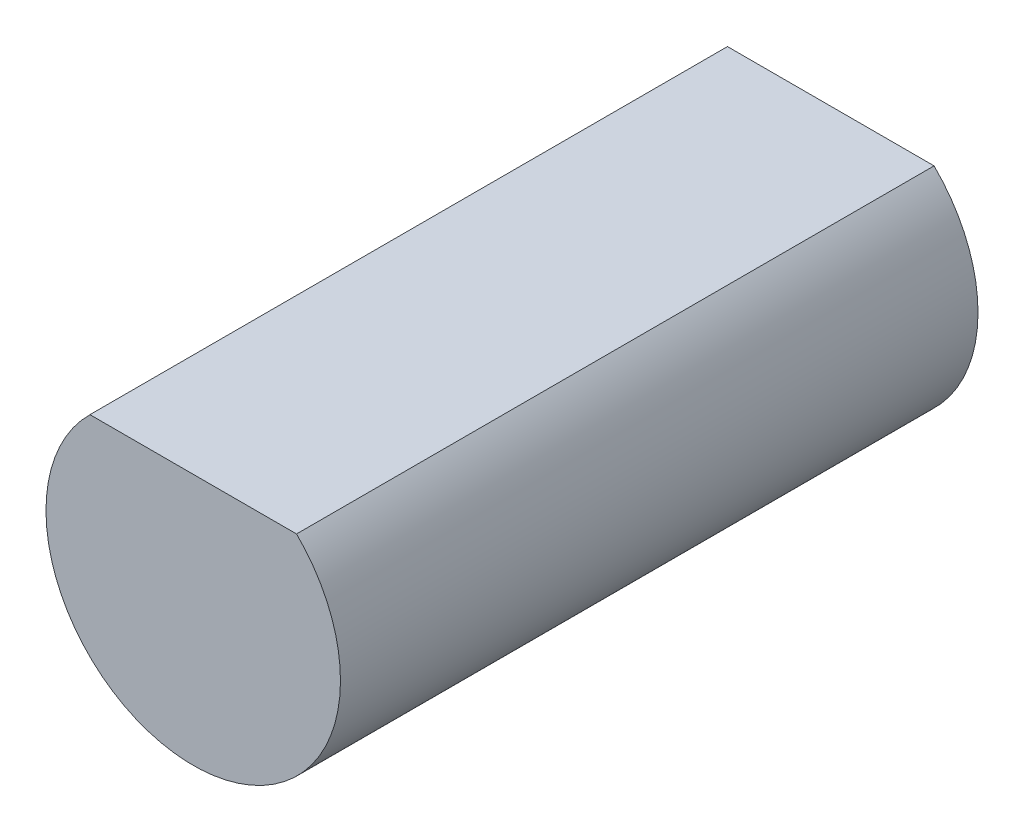
ISO-10303-21;
HEADER;
FILE_DESCRIPTION(('STEP AP214'),'2;1');
FILE_NAME('part.step','',(''),(''),'','','');
FILE_SCHEMA(('AUTOMOTIVE_DESIGN { 1 0 10303 214 1 1 1 1 }'));
ENDSEC;
DATA;
#1=APPLICATION_CONTEXT('core data for automotive mechanical design processes');
#2=APPLICATION_PROTOCOL_DEFINITION('international standard','automotive_design',2000,#1);
#3=PRODUCT_CONTEXT('',#1,'mechanical');
#4=PRODUCT('Part','Part','',(#3));
#5=PRODUCT_RELATED_PRODUCT_CATEGORY('part','',(#4));
#6=PRODUCT_DEFINITION_FORMATION('','',#4);
#7=PRODUCT_DEFINITION_CONTEXT('part definition',#1,'design');
#8=PRODUCT_DEFINITION('design','',#6,#7);
#9=PRODUCT_DEFINITION_SHAPE('','',#8);
#10=(LENGTH_UNIT() NAMED_UNIT(*) SI_UNIT(.MILLI.,.METRE.));
#11=(NAMED_UNIT(*) PLANE_ANGLE_UNIT() SI_UNIT($,.RADIAN.));
#12=(NAMED_UNIT(*) SI_UNIT($,.STERADIAN.) SOLID_ANGLE_UNIT());
#13=UNCERTAINTY_MEASURE_WITH_UNIT(LENGTH_MEASURE(1.E-05),#10,'distance_accuracy_value','');
#14=(GEOMETRIC_REPRESENTATION_CONTEXT(3) GLOBAL_UNCERTAINTY_ASSIGNED_CONTEXT((#13)) GLOBAL_UNIT_ASSIGNED_CONTEXT((#10,
#11,#12)) REPRESENTATION_CONTEXT('',''));
#15=CARTESIAN_POINT('',(0.,0.,0.));
#16=DIRECTION('',(0.,0.,1.));
#17=DIRECTION('',(1.,0.,0.));
#18=AXIS2_PLACEMENT_3D('',#15,#16,#17);
#19=CARTESIAN_POINT('',(0.,0.,17.32));
#20=DIRECTION('',(0.,0.,-1.));
#21=DIRECTION('',(-1.,0.,0.));
#22=AXIS2_PLACEMENT_3D('',#19,#20,#21);
#23=CYLINDRICAL_SURFACE('',#22,4.);
#24=CARTESIAN_POINT('',(0.,0.,0.));
#25=DIRECTION('',(0.,0.,1.));
#26=DIRECTION('',(1.,0.,0.));
#27=AXIS2_PLACEMENT_3D('',#24,#25,#26);
#28=CIRCLE('',#27,4.);
#29=CARTESIAN_POINT('',(-2.80668844013724,2.85,0.));
#30=VERTEX_POINT('',#29);
#31=CARTESIAN_POINT('',(2.80668844013724,2.85,0.));
#32=VERTEX_POINT('',#31);
#33=EDGE_CURVE('E76',#30,#32,#28,.T.);
#34=ORIENTED_EDGE('',*,*,#33,.T.);
#35=DIRECTION('',(0.,0.,-1.));
#36=VECTOR('',#35,1.);
#37=CARTESIAN_POINT('',(2.80668844013724,2.85,17.32));
#38=LINE('',#37,#36);
#39=CARTESIAN_POINT('',(2.80668844013724,2.85,17.32));
#40=VERTEX_POINT('',#39);
#41=EDGE_CURVE('E11',#40,#32,#38,.T.);
#42=ORIENTED_EDGE('',*,*,#41,.F.);
#43=CARTESIAN_POINT('',(0.,0.,17.32));
#44=DIRECTION('',(0.,0.,1.));
#45=DIRECTION('',(1.,0.,0.));
#46=AXIS2_PLACEMENT_3D('',#43,#44,#45);
#47=CIRCLE('',#46,4.);
#48=CARTESIAN_POINT('',(-2.80668844013724,2.85,17.32));
#49=VERTEX_POINT('',#48);
#50=EDGE_CURVE('E75',#49,#40,#47,.T.);
#51=ORIENTED_EDGE('',*,*,#50,.F.);
#52=DIRECTION('',(0.,0.,-1.));
#53=VECTOR('',#52,1.);
#54=CARTESIAN_POINT('',(-2.80668844013724,2.85,17.32));
#55=LINE('',#54,#53);
#56=EDGE_CURVE('E53',#49,#30,#55,.T.);
#57=ORIENTED_EDGE('',*,*,#56,.T.);
#58=EDGE_LOOP('',(#34,#42,#51,#57));
#59=FACE_BOUND('',#58,.T.);
#60=ADVANCED_FACE('F45',(#59),#23,.T.);
#61=CARTESIAN_POINT('',(-2.80668844013724,2.85,17.32));
#62=DIRECTION('',(0.,-1.,0.));
#63=DIRECTION('',(0.,0.,-1.));
#64=AXIS2_PLACEMENT_3D('',#61,#62,#63);
#65=PLANE('',#64);
#66=DIRECTION('',(-1.,0.,0.));
#67=VECTOR('',#66,1.);
#68=CARTESIAN_POINT('',(-2.80668844013724,2.85,0.));
#69=LINE('',#68,#67);
#70=EDGE_CURVE('E68',#32,#30,#69,.T.);
#71=ORIENTED_EDGE('',*,*,#70,.T.);
#72=ORIENTED_EDGE('',*,*,#56,.F.);
#73=DIRECTION('',(-1.,0.,0.));
#74=VECTOR('',#73,1.);
#75=CARTESIAN_POINT('',(-2.80668844013724,2.85,17.32));
#76=LINE('',#75,#74);
#77=EDGE_CURVE('E60',#40,#49,#76,.T.);
#78=ORIENTED_EDGE('',*,*,#77,.F.);
#79=ORIENTED_EDGE('',*,*,#41,.T.);
#80=EDGE_LOOP('',(#71,#72,#78,#79));
#81=FACE_BOUND('',#80,.T.);
#82=ADVANCED_FACE('F71',(#81),#65,.F.);
#83=CARTESIAN_POINT('',(0.,0.,17.32));
#84=DIRECTION('',(0.,0.,1.));
#85=DIRECTION('',(1.,0.,0.));
#86=AXIS2_PLACEMENT_3D('',#83,#84,#85);
#87=PLANE('',#86);
#88=ORIENTED_EDGE('',*,*,#50,.T.);
#89=ORIENTED_EDGE('',*,*,#77,.T.);
#90=EDGE_LOOP('',(#88,#89));
#91=FACE_BOUND('',#90,.T.);
#92=ADVANCED_FACE('F83',(#91),#87,.T.);
#93=CARTESIAN_POINT('',(0.,0.,0.));
#94=DIRECTION('',(0.,0.,1.));
#95=DIRECTION('',(1.,0.,0.));
#96=AXIS2_PLACEMENT_3D('',#93,#94,#95);
#97=PLANE('',#96);
#98=ORIENTED_EDGE('',*,*,#33,.F.);
#99=ORIENTED_EDGE('',*,*,#70,.F.);
#100=EDGE_LOOP('',(#98,#99));
#101=FACE_BOUND('',#100,.T.);
#102=ADVANCED_FACE('F79',(#101),#97,.F.);
#103=CLOSED_SHELL('',(#60,#82,#92,#102));
#104=MANIFOLD_SOLID_BREP('B2',#103);
#105=ADVANCED_BREP_SHAPE_REPRESENTATION('',(#18,#104),#14);
#106=SHAPE_DEFINITION_REPRESENTATION(#9,#105);
ENDSEC;
END-ISO-10303-21;
